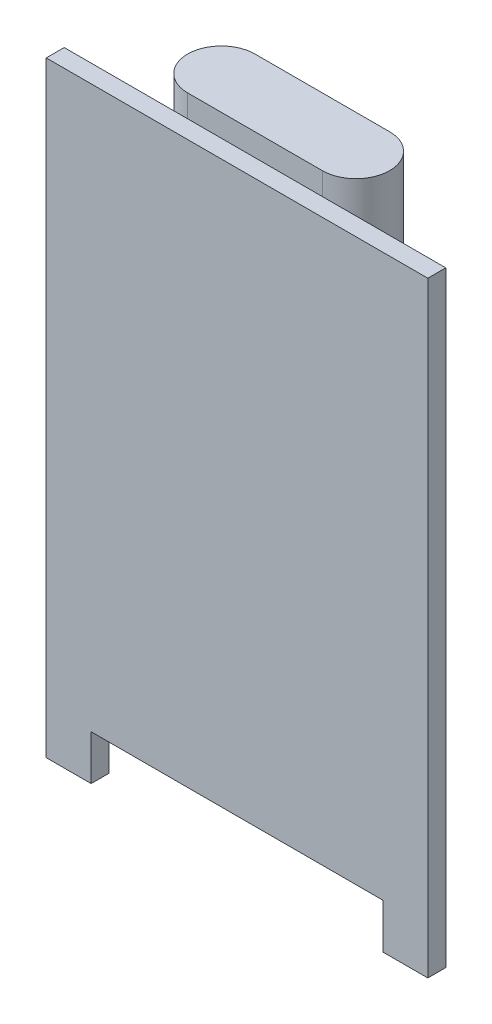
ISO-10303-21;
HEADER;
FILE_DESCRIPTION(('STEP AP214'),'2;1');
FILE_NAME('part.step','',(''),(''),'','','');
FILE_SCHEMA(('AUTOMOTIVE_DESIGN { 1 0 10303 214 1 1 1 1 }'));
ENDSEC;
DATA;
#1=APPLICATION_CONTEXT('core data for automotive mechanical design processes');
#2=APPLICATION_PROTOCOL_DEFINITION('international standard','automotive_design',2000,#1);
#3=PRODUCT_CONTEXT('',#1,'mechanical');
#4=PRODUCT('Part','Part','',(#3));
#5=PRODUCT_RELATED_PRODUCT_CATEGORY('part','',(#4));
#6=PRODUCT_DEFINITION_FORMATION('','',#4);
#7=PRODUCT_DEFINITION_CONTEXT('part definition',#1,'design');
#8=PRODUCT_DEFINITION('design','',#6,#7);
#9=PRODUCT_DEFINITION_SHAPE('','',#8);
#10=(LENGTH_UNIT() NAMED_UNIT(*) SI_UNIT(.MILLI.,.METRE.));
#11=(NAMED_UNIT(*) PLANE_ANGLE_UNIT() SI_UNIT($,.RADIAN.));
#12=(NAMED_UNIT(*) SI_UNIT($,.STERADIAN.) SOLID_ANGLE_UNIT());
#13=UNCERTAINTY_MEASURE_WITH_UNIT(LENGTH_MEASURE(1.E-05),#10,'distance_accuracy_value','');
#14=(GEOMETRIC_REPRESENTATION_CONTEXT(3) GLOBAL_UNCERTAINTY_ASSIGNED_CONTEXT((#13)) GLOBAL_UNIT_ASSIGNED_CONTEXT((#10,
#11,#12)) REPRESENTATION_CONTEXT('',''));
#15=CARTESIAN_POINT('',(0.,0.,0.));
#16=DIRECTION('',(0.,0.,1.));
#17=DIRECTION('',(1.,0.,0.));
#18=AXIS2_PLACEMENT_3D('',#15,#16,#17);
#19=CARTESIAN_POINT('',(0.,0.,0.));
#20=DIRECTION('',(0.,0.,1.));
#21=DIRECTION('',(1.,0.,0.));
#22=AXIS2_PLACEMENT_3D('',#19,#20,#21);
#23=PLANE('',#22);
#24=DIRECTION('',(0.,1.,0.));
#25=VECTOR('',#24,1.);
#26=CARTESIAN_POINT('',(-3.,7.5,0.));
#27=LINE('',#26,#25);
#28=CARTESIAN_POINT('',(-3.,7.5,0.));
#29=VERTEX_POINT('',#28);
#30=CARTESIAN_POINT('',(-3.,13.5,0.));
#31=VERTEX_POINT('',#30);
#32=EDGE_CURVE('E135',#29,#31,#27,.T.);
#33=ORIENTED_EDGE('',*,*,#32,.F.);
#34=DIRECTION('',(1.,0.,0.));
#35=VECTOR('',#34,1.);
#36=CARTESIAN_POINT('',(-3.,7.5,0.));
#37=LINE('',#36,#35);
#38=CARTESIAN_POINT('',(3.,7.5,0.));
#39=VERTEX_POINT('',#38);
#40=EDGE_CURVE('E50',#29,#39,#37,.T.);
#41=ORIENTED_EDGE('',*,*,#40,.T.);
#42=DIRECTION('',(0.,1.,0.));
#43=VECTOR('',#42,1.);
#44=CARTESIAN_POINT('',(3.,7.5,0.));
#45=LINE('',#44,#43);
#46=CARTESIAN_POINT('',(3.,13.5,0.));
#47=VERTEX_POINT('',#46);
#48=EDGE_CURVE('E54',#39,#47,#45,.T.);
#49=ORIENTED_EDGE('',*,*,#48,.T.);
#50=DIRECTION('',(1.,0.,0.));
#51=VECTOR('',#50,1.);
#52=CARTESIAN_POINT('',(0.,13.5,0.));
#53=LINE('',#52,#51);
#54=CARTESIAN_POINT('',(8.5,13.5,0.));
#55=VERTEX_POINT('',#54);
#56=EDGE_CURVE('E204',#47,#55,#53,.T.);
#57=ORIENTED_EDGE('',*,*,#56,.T.);
#58=DIRECTION('',(0.,-1.,0.));
#59=VECTOR('',#58,1.);
#60=CARTESIAN_POINT('',(8.5,0.,0.));
#61=LINE('',#60,#59);
#62=CARTESIAN_POINT('',(8.5,-13.5,0.));
#63=VERTEX_POINT('',#62);
#64=EDGE_CURVE('E200',#55,#63,#61,.T.);
#65=ORIENTED_EDGE('',*,*,#64,.T.);
#66=DIRECTION('',(1.,0.,0.));
#67=VECTOR('',#66,1.);
#68=CARTESIAN_POINT('',(0.,-13.5,0.));
#69=LINE('',#68,#67);
#70=CARTESIAN_POINT('',(6.5,-13.5,0.));
#71=VERTEX_POINT('',#70);
#72=EDGE_CURVE('E197',#71,#63,#69,.T.);
#73=ORIENTED_EDGE('',*,*,#72,.F.);
#74=DIRECTION('',(0.,-1.,0.));
#75=VECTOR('',#74,1.);
#76=CARTESIAN_POINT('',(6.5,0.,0.));
#77=LINE('',#76,#75);
#78=CARTESIAN_POINT('',(6.5,-11.5,0.));
#79=VERTEX_POINT('',#78);
#80=EDGE_CURVE('E195',#79,#71,#77,.T.);
#81=ORIENTED_EDGE('',*,*,#80,.F.);
#82=DIRECTION('',(1.,0.,0.));
#83=VECTOR('',#82,1.);
#84=CARTESIAN_POINT('',(0.,-11.5,0.));
#85=LINE('',#84,#83);
#86=CARTESIAN_POINT('',(-6.5,-11.5,0.));
#87=VERTEX_POINT('',#86);
#88=EDGE_CURVE('E168',#87,#79,#85,.T.);
#89=ORIENTED_EDGE('',*,*,#88,.F.);
#90=DIRECTION('',(0.,-1.,0.));
#91=VECTOR('',#90,1.);
#92=CARTESIAN_POINT('',(-6.50000000000001,0.,0.));
#93=LINE('',#92,#91);
#94=CARTESIAN_POINT('',(-6.5,-13.5,0.));
#95=VERTEX_POINT('',#94);
#96=EDGE_CURVE('E176',#87,#95,#93,.T.);
#97=ORIENTED_EDGE('',*,*,#96,.T.);
#98=CARTESIAN_POINT('',(-8.5,-13.5,0.));
#99=VERTEX_POINT('',#98);
#100=EDGE_CURVE('E201',#99,#95,#69,.T.);
#101=ORIENTED_EDGE('',*,*,#100,.F.);
#102=DIRECTION('',(0.,-1.,0.));
#103=VECTOR('',#102,1.);
#104=CARTESIAN_POINT('',(-8.5,0.,0.));
#105=LINE('',#104,#103);
#106=CARTESIAN_POINT('',(-8.5,13.5,0.));
#107=VERTEX_POINT('',#106);
#108=EDGE_CURVE('E208',#107,#99,#105,.T.);
#109=ORIENTED_EDGE('',*,*,#108,.F.);
#110=EDGE_CURVE('E205',#107,#31,#53,.T.);
#111=ORIENTED_EDGE('',*,*,#110,.T.);
#112=EDGE_LOOP('',(#33,#41,#49,#57,#65,#73,#81,#89,#97,#101,#109,#111));
#113=FACE_BOUND('',#112,.T.);
#114=ADVANCED_FACE('F35',(#113),#23,.F.);
#115=CARTESIAN_POINT('',(0.,-11.5,0.8));
#116=DIRECTION('',(0.,1.,0.));
#117=DIRECTION('',(0.,0.,1.));
#118=AXIS2_PLACEMENT_3D('',#115,#116,#117);
#119=PLANE('',#118);
#120=ORIENTED_EDGE('',*,*,#88,.T.);
#121=DIRECTION('',(0.,0.,-1.));
#122=VECTOR('',#121,1.);
#123=CARTESIAN_POINT('',(6.5,-11.5,0.8));
#124=LINE('',#123,#122);
#125=CARTESIAN_POINT('',(6.5,-11.5,0.8));
#126=VERTEX_POINT('',#125);
#127=EDGE_CURVE('E11',#126,#79,#124,.T.);
#128=ORIENTED_EDGE('',*,*,#127,.F.);
#129=DIRECTION('',(1.,0.,0.));
#130=VECTOR('',#129,1.);
#131=CARTESIAN_POINT('',(0.,-11.5,0.8));
#132=LINE('',#131,#130);
#133=CARTESIAN_POINT('',(-6.5,-11.5,0.8));
#134=VERTEX_POINT('',#133);
#135=EDGE_CURVE('E172',#134,#126,#132,.T.);
#136=ORIENTED_EDGE('',*,*,#135,.F.);
#137=DIRECTION('',(0.,0.,-1.));
#138=VECTOR('',#137,1.);
#139=CARTESIAN_POINT('',(-6.5,-11.5,0.8));
#140=LINE('',#139,#138);
#141=EDGE_CURVE('E192',#134,#87,#140,.T.);
#142=ORIENTED_EDGE('',*,*,#141,.T.);
#143=EDGE_LOOP('',(#120,#128,#136,#142));
#144=FACE_BOUND('',#143,.T.);
#145=ADVANCED_FACE('F37',(#144),#119,.F.);
#146=CARTESIAN_POINT('',(6.5,0.,0.8));
#147=DIRECTION('',(1.,0.,0.));
#148=DIRECTION('',(0.,0.,-1.));
#149=AXIS2_PLACEMENT_3D('',#146,#147,#148);
#150=PLANE('',#149);
#151=ORIENTED_EDGE('',*,*,#80,.T.);
#152=DIRECTION('',(0.,0.,-1.));
#153=VECTOR('',#152,1.);
#154=CARTESIAN_POINT('',(6.5,-13.5,0.8));
#155=LINE('',#154,#153);
#156=CARTESIAN_POINT('',(6.5,-13.5,0.8));
#157=VERTEX_POINT('',#156);
#158=EDGE_CURVE('E43',#157,#71,#155,.T.);
#159=ORIENTED_EDGE('',*,*,#158,.F.);
#160=DIRECTION('',(0.,-1.,0.));
#161=VECTOR('',#160,1.);
#162=CARTESIAN_POINT('',(6.5,0.,0.8));
#163=LINE('',#162,#161);
#164=EDGE_CURVE('E175',#126,#157,#163,.T.);
#165=ORIENTED_EDGE('',*,*,#164,.F.);
#166=ORIENTED_EDGE('',*,*,#127,.T.);
#167=EDGE_LOOP('',(#151,#159,#165,#166));
#168=FACE_BOUND('',#167,.T.);
#169=ADVANCED_FACE('F262',(#168),#150,.F.);
#170=CARTESIAN_POINT('',(0.,-13.5,0.8));
#171=DIRECTION('',(0.,1.,0.));
#172=DIRECTION('',(0.,0.,1.));
#173=AXIS2_PLACEMENT_3D('',#170,#171,#172);
#174=PLANE('',#173);
#175=ORIENTED_EDGE('',*,*,#72,.T.);
#176=DIRECTION('',(0.,0.,-1.));
#177=VECTOR('',#176,1.);
#178=CARTESIAN_POINT('',(8.5,-13.5,0.8));
#179=LINE('',#178,#177);
#180=CARTESIAN_POINT('',(8.5,-13.5,0.8));
#181=VERTEX_POINT('',#180);
#182=EDGE_CURVE('E224',#181,#63,#179,.T.);
#183=ORIENTED_EDGE('',*,*,#182,.F.);
#184=DIRECTION('',(1.,0.,0.));
#185=VECTOR('',#184,1.);
#186=CARTESIAN_POINT('',(0.,-13.5,0.8));
#187=LINE('',#186,#185);
#188=EDGE_CURVE('E178',#157,#181,#187,.T.);
#189=ORIENTED_EDGE('',*,*,#188,.F.);
#190=ORIENTED_EDGE('',*,*,#158,.T.);
#191=EDGE_LOOP('',(#175,#183,#189,#190));
#192=FACE_BOUND('',#191,.T.);
#193=ADVANCED_FACE('F230',(#192),#174,.F.);
#194=CARTESIAN_POINT('',(8.5,0.,0.8));
#195=DIRECTION('',(1.,0.,0.));
#196=DIRECTION('',(0.,1.,0.));
#197=AXIS2_PLACEMENT_3D('',#194,#195,#196);
#198=PLANE('',#197);
#199=ORIENTED_EDGE('',*,*,#64,.F.);
#200=DIRECTION('',(0.,0.,-1.));
#201=VECTOR('',#200,1.);
#202=CARTESIAN_POINT('',(8.5,13.5,0.8));
#203=LINE('',#202,#201);
#204=CARTESIAN_POINT('',(8.5,13.5,0.8));
#205=VERTEX_POINT('',#204);
#206=EDGE_CURVE('E221',#205,#55,#203,.T.);
#207=ORIENTED_EDGE('',*,*,#206,.F.);
#208=DIRECTION('',(0.,-1.,0.));
#209=VECTOR('',#208,1.);
#210=CARTESIAN_POINT('',(8.5,0.,0.8));
#211=LINE('',#210,#209);
#212=EDGE_CURVE('E180',#205,#181,#211,.T.);
#213=ORIENTED_EDGE('',*,*,#212,.T.);
#214=ORIENTED_EDGE('',*,*,#182,.T.);
#215=EDGE_LOOP('',(#199,#207,#213,#214));
#216=FACE_BOUND('',#215,.T.);
#217=ADVANCED_FACE('F236',(#216),#198,.T.);
#218=CARTESIAN_POINT('',(0.,13.5,0.8));
#219=DIRECTION('',(0.,1.,0.));
#220=DIRECTION('',(0.,0.,1.));
#221=AXIS2_PLACEMENT_3D('',#218,#219,#220);
#222=PLANE('',#221);
#223=ORIENTED_EDGE('',*,*,#110,.F.);
#224=DIRECTION('',(0.,0.,-1.));
#225=VECTOR('',#224,1.);
#226=CARTESIAN_POINT('',(-8.5,13.5,0.8));
#227=LINE('',#226,#225);
#228=CARTESIAN_POINT('',(-8.5,13.5,0.8));
#229=VERTEX_POINT('',#228);
#230=EDGE_CURVE('E219',#229,#107,#227,.T.);
#231=ORIENTED_EDGE('',*,*,#230,.F.);
#232=DIRECTION('',(1.,0.,0.));
#233=VECTOR('',#232,1.);
#234=CARTESIAN_POINT('',(0.,13.5,0.8));
#235=LINE('',#234,#233);
#236=EDGE_CURVE('E184',#229,#205,#235,.T.);
#237=ORIENTED_EDGE('',*,*,#236,.T.);
#238=ORIENTED_EDGE('',*,*,#206,.T.);
#239=ORIENTED_EDGE('',*,*,#56,.F.);
#240=EDGE_CURVE('E209',#31,#47,#53,.T.);
#241=ORIENTED_EDGE('',*,*,#240,.F.);
#242=EDGE_LOOP('',(#223,#231,#237,#238,#239,#241));
#243=FACE_BOUND('',#242,.T.);
#244=ADVANCED_FACE('F243',(#243),#222,.T.);
#245=CARTESIAN_POINT('',(-8.5,0.,0.8));
#246=DIRECTION('',(1.,0.,0.));
#247=DIRECTION('',(0.,1.,0.));
#248=AXIS2_PLACEMENT_3D('',#245,#246,#247);
#249=PLANE('',#248);
#250=ORIENTED_EDGE('',*,*,#108,.T.);
#251=DIRECTION('',(0.,0.,-1.));
#252=VECTOR('',#251,1.);
#253=CARTESIAN_POINT('',(-8.5,-13.5,0.8));
#254=LINE('',#253,#252);
#255=CARTESIAN_POINT('',(-8.5,-13.5,0.8));
#256=VERTEX_POINT('',#255);
#257=EDGE_CURVE('E216',#256,#99,#254,.T.);
#258=ORIENTED_EDGE('',*,*,#257,.F.);
#259=DIRECTION('',(0.,-1.,0.));
#260=VECTOR('',#259,1.);
#261=CARTESIAN_POINT('',(-8.5,0.,0.8));
#262=LINE('',#261,#260);
#263=EDGE_CURVE('E187',#229,#256,#262,.T.);
#264=ORIENTED_EDGE('',*,*,#263,.F.);
#265=ORIENTED_EDGE('',*,*,#230,.T.);
#266=EDGE_LOOP('',(#250,#258,#264,#265));
#267=FACE_BOUND('',#266,.T.);
#268=ADVANCED_FACE('F248',(#267),#249,.F.);
#269=ORIENTED_EDGE('',*,*,#100,.T.);
#270=DIRECTION('',(0.,0.,-1.));
#271=VECTOR('',#270,1.);
#272=CARTESIAN_POINT('',(-6.5,-13.5,0.8));
#273=LINE('',#272,#271);
#274=CARTESIAN_POINT('',(-6.5,-13.5,0.8));
#275=VERTEX_POINT('',#274);
#276=EDGE_CURVE('E214',#275,#95,#273,.T.);
#277=ORIENTED_EDGE('',*,*,#276,.F.);
#278=EDGE_CURVE('E181',#256,#275,#187,.T.);
#279=ORIENTED_EDGE('',*,*,#278,.F.);
#280=ORIENTED_EDGE('',*,*,#257,.T.);
#281=EDGE_LOOP('',(#269,#277,#279,#280));
#282=FACE_BOUND('',#281,.T.);
#283=ADVANCED_FACE('F254',(#282),#174,.F.);
#284=CARTESIAN_POINT('',(-6.50000000000001,0.,0.8));
#285=DIRECTION('',(1.,0.,0.));
#286=DIRECTION('',(0.,1.,0.));
#287=AXIS2_PLACEMENT_3D('',#284,#285,#286);
#288=PLANE('',#287);
#289=ORIENTED_EDGE('',*,*,#96,.F.);
#290=ORIENTED_EDGE('',*,*,#141,.F.);
#291=DIRECTION('',(0.,-1.,0.));
#292=VECTOR('',#291,1.);
#293=CARTESIAN_POINT('',(-6.50000000000001,0.,0.8));
#294=LINE('',#293,#292);
#295=EDGE_CURVE('E189',#134,#275,#294,.T.);
#296=ORIENTED_EDGE('',*,*,#295,.T.);
#297=ORIENTED_EDGE('',*,*,#276,.T.);
#298=EDGE_LOOP('',(#289,#290,#296,#297));
#299=FACE_BOUND('',#298,.T.);
#300=ADVANCED_FACE('F258',(#299),#288,.T.);
#301=CARTESIAN_POINT('',(0.,0.,0.8));
#302=DIRECTION('',(0.,0.,1.));
#303=DIRECTION('',(1.,0.,0.));
#304=AXIS2_PLACEMENT_3D('',#301,#302,#303);
#305=PLANE('',#304);
#306=ORIENTED_EDGE('',*,*,#135,.T.);
#307=ORIENTED_EDGE('',*,*,#164,.T.);
#308=ORIENTED_EDGE('',*,*,#188,.T.);
#309=ORIENTED_EDGE('',*,*,#212,.F.);
#310=ORIENTED_EDGE('',*,*,#236,.F.);
#311=ORIENTED_EDGE('',*,*,#263,.T.);
#312=ORIENTED_EDGE('',*,*,#278,.T.);
#313=ORIENTED_EDGE('',*,*,#295,.F.);
#314=EDGE_LOOP('',(#306,#307,#308,#309,#310,#311,#312,#313));
#315=FACE_BOUND('',#314,.T.);
#316=ADVANCED_FACE('F240',(#315),#305,.T.);
#317=CARTESIAN_POINT('',(-3.,7.5,-1.5));
#318=DIRECTION('',(0.,1.,0.));
#319=DIRECTION('',(0.,0.,1.));
#320=AXIS2_PLACEMENT_3D('',#317,#318,#319);
#321=CYLINDRICAL_SURFACE('',#320,1.5);
#322=ORIENTED_EDGE('',*,*,#32,.T.);
#323=CARTESIAN_POINT('',(-3.,14.5,0.));
#324=VERTEX_POINT('',#323);
#325=EDGE_CURVE('E129',#31,#324,#27,.T.);
#326=ORIENTED_EDGE('',*,*,#325,.T.);
#327=CARTESIAN_POINT('',(-3.,14.5,-1.5));
#328=DIRECTION('',(0.,1.,0.));
#329=DIRECTION('',(0.,0.,1.));
#330=AXIS2_PLACEMENT_3D('',#327,#328,#329);
#331=CIRCLE('',#330,1.5);
#332=CARTESIAN_POINT('',(-3.,14.5,-3.));
#333=VERTEX_POINT('',#332);
#334=EDGE_CURVE('E133',#333,#324,#331,.T.);
#335=ORIENTED_EDGE('',*,*,#334,.F.);
#336=DIRECTION('',(0.,1.,0.));
#337=VECTOR('',#336,1.);
#338=CARTESIAN_POINT('',(-3.,7.5,-3.));
#339=LINE('',#338,#337);
#340=CARTESIAN_POINT('',(-3.,7.5,-3.));
#341=VERTEX_POINT('',#340);
#342=EDGE_CURVE('E166',#341,#333,#339,.T.);
#343=ORIENTED_EDGE('',*,*,#342,.F.);
#344=CARTESIAN_POINT('',(-3.,7.5,-1.5));
#345=DIRECTION('',(0.,1.,0.));
#346=DIRECTION('',(0.,0.,1.));
#347=AXIS2_PLACEMENT_3D('',#344,#345,#346);
#348=CIRCLE('',#347,1.5);
#349=EDGE_CURVE('E158',#341,#29,#348,.T.);
#350=ORIENTED_EDGE('',*,*,#349,.T.);
#351=EDGE_LOOP('',(#322,#326,#335,#343,#350));
#352=FACE_BOUND('',#351,.T.);
#353=ADVANCED_FACE('F131',(#352),#321,.T.);
#354=CARTESIAN_POINT('',(-3.,7.5,-3.));
#355=DIRECTION('',(0.,0.,-1.));
#356=DIRECTION('',(-1.,0.,0.));
#357=AXIS2_PLACEMENT_3D('',#354,#355,#356);
#358=PLANE('',#357);
#359=ORIENTED_EDGE('',*,*,#342,.T.);
#360=DIRECTION('',(-1.,0.,0.));
#361=VECTOR('',#360,1.);
#362=CARTESIAN_POINT('',(-3.,14.5,-3.));
#363=LINE('',#362,#361);
#364=CARTESIAN_POINT('',(3.,14.5,-3.));
#365=VERTEX_POINT('',#364);
#366=EDGE_CURVE('E153',#365,#333,#363,.T.);
#367=ORIENTED_EDGE('',*,*,#366,.F.);
#368=DIRECTION('',(0.,1.,0.));
#369=VECTOR('',#368,1.);
#370=CARTESIAN_POINT('',(3.,7.5,-3.));
#371=LINE('',#370,#369);
#372=CARTESIAN_POINT('',(3.,7.5,-3.));
#373=VERTEX_POINT('',#372);
#374=EDGE_CURVE('E169',#373,#365,#371,.T.);
#375=ORIENTED_EDGE('',*,*,#374,.F.);
#376=DIRECTION('',(-1.,0.,0.));
#377=VECTOR('',#376,1.);
#378=CARTESIAN_POINT('',(-3.,7.5,-3.));
#379=LINE('',#378,#377);
#380=EDGE_CURVE('E138',#373,#341,#379,.T.);
#381=ORIENTED_EDGE('',*,*,#380,.T.);
#382=EDGE_LOOP('',(#359,#367,#375,#381));
#383=FACE_BOUND('',#382,.T.);
#384=ADVANCED_FACE('F269',(#383),#358,.T.);
#385=CARTESIAN_POINT('',(3.,7.5,-1.5));
#386=DIRECTION('',(0.,1.,0.));
#387=DIRECTION('',(0.,0.,1.));
#388=AXIS2_PLACEMENT_3D('',#385,#386,#387);
#389=CYLINDRICAL_SURFACE('',#388,1.5);
#390=ORIENTED_EDGE('',*,*,#374,.T.);
#391=CARTESIAN_POINT('',(3.,14.5,-1.5));
#392=DIRECTION('',(0.,1.,0.));
#393=DIRECTION('',(0.,0.,1.));
#394=AXIS2_PLACEMENT_3D('',#391,#392,#393);
#395=CIRCLE('',#394,1.5);
#396=CARTESIAN_POINT('',(3.,14.5,0.));
#397=VERTEX_POINT('',#396);
#398=EDGE_CURVE('E148',#397,#365,#395,.T.);
#399=ORIENTED_EDGE('',*,*,#398,.F.);
#400=EDGE_CURVE('E144',#47,#397,#45,.T.);
#401=ORIENTED_EDGE('',*,*,#400,.F.);
#402=ORIENTED_EDGE('',*,*,#48,.F.);
#403=CARTESIAN_POINT('',(3.,7.5,-1.5));
#404=DIRECTION('',(0.,1.,0.));
#405=DIRECTION('',(0.,0.,1.));
#406=AXIS2_PLACEMENT_3D('',#403,#404,#405);
#407=CIRCLE('',#406,1.5);
#408=EDGE_CURVE('E161',#39,#373,#407,.T.);
#409=ORIENTED_EDGE('',*,*,#408,.T.);
#410=EDGE_LOOP('',(#390,#399,#401,#402,#409));
#411=FACE_BOUND('',#410,.T.);
#412=ADVANCED_FACE('F271',(#411),#389,.T.);
#413=CARTESIAN_POINT('',(-3.,7.5,0.));
#414=DIRECTION('',(0.,0.,1.));
#415=DIRECTION('',(1.,0.,0.));
#416=AXIS2_PLACEMENT_3D('',#413,#414,#415);
#417=PLANE('',#416);
#418=ORIENTED_EDGE('',*,*,#325,.F.);
#419=ORIENTED_EDGE('',*,*,#240,.T.);
#420=ORIENTED_EDGE('',*,*,#400,.T.);
#421=DIRECTION('',(1.,0.,0.));
#422=VECTOR('',#421,1.);
#423=CARTESIAN_POINT('',(-3.,14.5,0.));
#424=LINE('',#423,#422);
#425=EDGE_CURVE('E141',#324,#397,#424,.T.);
#426=ORIENTED_EDGE('',*,*,#425,.F.);
#427=EDGE_LOOP('',(#418,#419,#420,#426));
#428=FACE_BOUND('',#427,.T.);
#429=ADVANCED_FACE('F142',(#428),#417,.T.);
#430=CARTESIAN_POINT('',(-3.,7.5,-1.5));
#431=DIRECTION('',(0.,1.,0.));
#432=DIRECTION('',(0.,0.,1.));
#433=AXIS2_PLACEMENT_3D('',#430,#431,#432);
#434=PLANE('',#433);
#435=ORIENTED_EDGE('',*,*,#349,.F.);
#436=ORIENTED_EDGE('',*,*,#380,.F.);
#437=ORIENTED_EDGE('',*,*,#408,.F.);
#438=ORIENTED_EDGE('',*,*,#40,.F.);
#439=EDGE_LOOP('',(#435,#436,#437,#438));
#440=FACE_BOUND('',#439,.T.);
#441=ADVANCED_FACE('F266',(#440),#434,.F.);
#442=CARTESIAN_POINT('',(-3.,14.5,-1.5));
#443=DIRECTION('',(0.,1.,0.));
#444=DIRECTION('',(0.,0.,1.));
#445=AXIS2_PLACEMENT_3D('',#442,#443,#444);
#446=PLANE('',#445);
#447=ORIENTED_EDGE('',*,*,#334,.T.);
#448=ORIENTED_EDGE('',*,*,#425,.T.);
#449=ORIENTED_EDGE('',*,*,#398,.T.);
#450=ORIENTED_EDGE('',*,*,#366,.T.);
#451=EDGE_LOOP('',(#447,#448,#449,#450));
#452=FACE_BOUND('',#451,.T.);
#453=ADVANCED_FACE('F151',(#452),#446,.T.);
#454=CLOSED_SHELL('',(#114,#145,#169,#193,#217,#244,#268,#283,#300,#316,#353,#384,#412,#429,
#441,#453));
#455=MANIFOLD_SOLID_BREP('B2',#454);
#456=ADVANCED_BREP_SHAPE_REPRESENTATION('',(#18,#455),#14);
#457=SHAPE_DEFINITION_REPRESENTATION(#9,#456);
ENDSEC;
END-ISO-10303-21;
